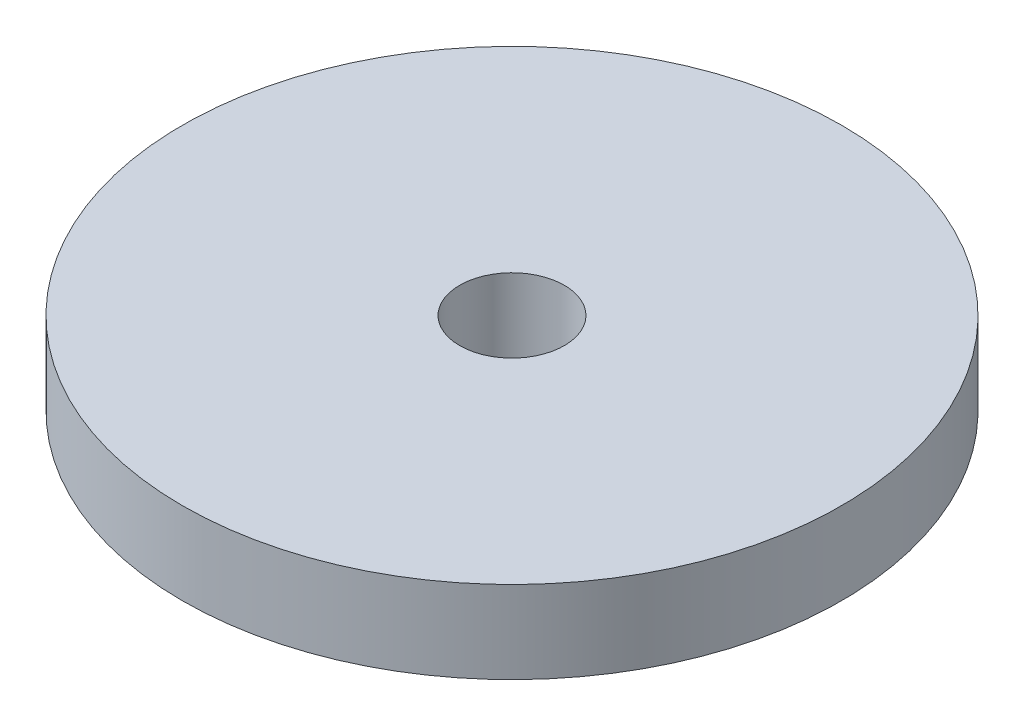
ISO-10303-21;
HEADER;
FILE_DESCRIPTION(('STEP AP214'),'2;1');
FILE_NAME('part.step','',(''),(''),'','','');
FILE_SCHEMA(('AUTOMOTIVE_DESIGN { 1 0 10303 214 1 1 1 1 }'));
ENDSEC;
DATA;
#1=APPLICATION_CONTEXT('core data for automotive mechanical design processes');
#2=APPLICATION_PROTOCOL_DEFINITION('international standard','automotive_design',2000,#1);
#3=PRODUCT_CONTEXT('',#1,'mechanical');
#4=PRODUCT('Part','Part','',(#3));
#5=PRODUCT_RELATED_PRODUCT_CATEGORY('part','',(#4));
#6=PRODUCT_DEFINITION_FORMATION('','',#4);
#7=PRODUCT_DEFINITION_CONTEXT('part definition',#1,'design');
#8=PRODUCT_DEFINITION('design','',#6,#7);
#9=PRODUCT_DEFINITION_SHAPE('','',#8);
#10=(LENGTH_UNIT() NAMED_UNIT(*) SI_UNIT(.MILLI.,.METRE.));
#11=(NAMED_UNIT(*) PLANE_ANGLE_UNIT() SI_UNIT($,.RADIAN.));
#12=(NAMED_UNIT(*) SI_UNIT($,.STERADIAN.) SOLID_ANGLE_UNIT());
#13=UNCERTAINTY_MEASURE_WITH_UNIT(LENGTH_MEASURE(1.E-05),#10,'distance_accuracy_value','');
#14=(GEOMETRIC_REPRESENTATION_CONTEXT(3) GLOBAL_UNCERTAINTY_ASSIGNED_CONTEXT((#13)) GLOBAL_UNIT_ASSIGNED_CONTEXT((#10,
#11,#12)) REPRESENTATION_CONTEXT('',''));
#15=CARTESIAN_POINT('',(0.,0.,0.));
#16=DIRECTION('',(0.,0.,1.));
#17=DIRECTION('',(1.,0.,0.));
#18=AXIS2_PLACEMENT_3D('',#15,#16,#17);
#19=CARTESIAN_POINT('',(-7.2414581097604,5.,-12.1360302406224));
#20=DIRECTION('',(0.,1.,0.));
#21=DIRECTION('',(0.,0.,1.));
#22=AXIS2_PLACEMENT_3D('',#19,#20,#21);
#23=PLANE('',#22);
#24=CARTESIAN_POINT('',(-7.2414581097604,5.,-12.1360302406224));
#25=DIRECTION('',(0.,1.,0.));
#26=DIRECTION('',(0.,0.,1.));
#27=AXIS2_PLACEMENT_3D('',#24,#25,#26);
#28=CIRCLE('',#27,20.);
#29=CARTESIAN_POINT('',(-7.2414581097604,5.,7.86396975937763));
#30=VERTEX_POINT('',#29);
#31=EDGE_CURVE('E10',#30,#30,#28,.T.);
#32=ORIENTED_EDGE('',*,*,#31,.T.);
#33=EDGE_LOOP('',(#32));
#34=FACE_BOUND('',#33,.T.);
#35=CARTESIAN_POINT('',(-7.2414581097604,5.,-12.1360302406224));
#36=DIRECTION('',(0.,1.,0.));
#37=DIRECTION('',(0.,0.,1.));
#38=AXIS2_PLACEMENT_3D('',#35,#36,#37);
#39=CIRCLE('',#38,3.175);
#40=CARTESIAN_POINT('',(-7.2414581097604,5.,-8.96103024062237));
#41=VERTEX_POINT('',#40);
#42=EDGE_CURVE('E42',#41,#41,#39,.T.);
#43=ORIENTED_EDGE('',*,*,#42,.F.);
#44=EDGE_LOOP('',(#43));
#45=FACE_BOUND('',#44,.T.);
#46=ADVANCED_FACE('F31',(#34,#45),#23,.T.);
#47=CARTESIAN_POINT('',(-7.2414581097604,0.,-12.1360302406224));
#48=DIRECTION('',(0.,1.,0.));
#49=DIRECTION('',(0.,0.,1.));
#50=AXIS2_PLACEMENT_3D('',#47,#48,#49);
#51=PLANE('',#50);
#52=CARTESIAN_POINT('',(-7.2414581097604,0.,-12.1360302406224));
#53=DIRECTION('',(0.,1.,0.));
#54=DIRECTION('',(0.,0.,1.));
#55=AXIS2_PLACEMENT_3D('',#52,#53,#54);
#56=CIRCLE('',#55,20.);
#57=CARTESIAN_POINT('',(-7.2414581097604,0.,7.86396975937763));
#58=VERTEX_POINT('',#57);
#59=EDGE_CURVE('E35',#58,#58,#56,.T.);
#60=ORIENTED_EDGE('',*,*,#59,.F.);
#61=EDGE_LOOP('',(#60));
#62=FACE_BOUND('',#61,.T.);
#63=CARTESIAN_POINT('',(-7.2414581097604,0.,-12.1360302406224));
#64=DIRECTION('',(0.,1.,0.));
#65=DIRECTION('',(0.,0.,1.));
#66=AXIS2_PLACEMENT_3D('',#63,#64,#65);
#67=CIRCLE('',#66,3.175);
#68=CARTESIAN_POINT('',(-7.2414581097604,0.,-8.96103024062237));
#69=VERTEX_POINT('',#68);
#70=EDGE_CURVE('E44',#69,#69,#67,.T.);
#71=ORIENTED_EDGE('',*,*,#70,.T.);
#72=EDGE_LOOP('',(#71));
#73=FACE_BOUND('',#72,.T.);
#74=ADVANCED_FACE('F54',(#62,#73),#51,.F.);
#75=CARTESIAN_POINT('',(-7.2414581097604,5.,-12.1360302406224));
#76=DIRECTION('',(0.,-1.,0.));
#77=DIRECTION('',(0.,0.,-1.));
#78=AXIS2_PLACEMENT_3D('',#75,#76,#77);
#79=CYLINDRICAL_SURFACE('',#78,20.);
#80=ORIENTED_EDGE('',*,*,#31,.F.);
#81=EDGE_LOOP('',(#80));
#82=FACE_BOUND('',#81,.T.);
#83=ORIENTED_EDGE('',*,*,#59,.T.);
#84=EDGE_LOOP('',(#83));
#85=FACE_BOUND('',#84,.T.);
#86=ADVANCED_FACE('F33',(#82,#85),#79,.T.);
#87=CARTESIAN_POINT('',(-7.2414581097604,5.,-12.1360302406224));
#88=DIRECTION('',(0.,-1.,0.));
#89=DIRECTION('',(0.,0.,-1.));
#90=AXIS2_PLACEMENT_3D('',#87,#88,#89);
#91=CYLINDRICAL_SURFACE('',#90,3.175);
#92=ORIENTED_EDGE('',*,*,#42,.T.);
#93=EDGE_LOOP('',(#92));
#94=FACE_BOUND('',#93,.T.);
#95=ORIENTED_EDGE('',*,*,#70,.F.);
#96=EDGE_LOOP('',(#95));
#97=FACE_BOUND('',#96,.T.);
#98=ADVANCED_FACE('F50',(#94,#97),#91,.F.);
#99=CLOSED_SHELL('',(#46,#74,#86,#98));
#100=MANIFOLD_SOLID_BREP('B2',#99);
#101=ADVANCED_BREP_SHAPE_REPRESENTATION('',(#18,#100),#14);
#102=SHAPE_DEFINITION_REPRESENTATION(#9,#101);
ENDSEC;
END-ISO-10303-21;
